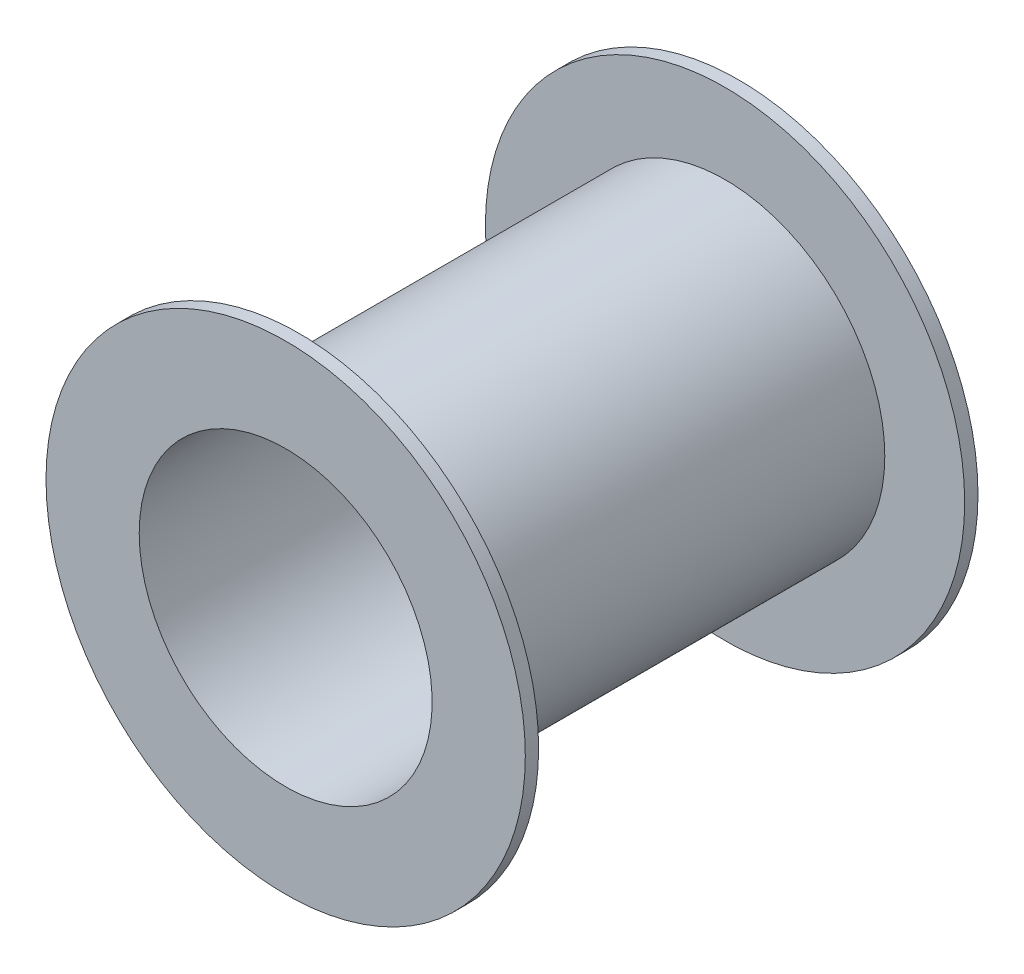
ISO-10303-21;
HEADER;
FILE_DESCRIPTION(('STEP AP214'),'2;1');
FILE_NAME('part.step','',(''),(''),'','','');
FILE_SCHEMA(('AUTOMOTIVE_DESIGN { 1 0 10303 214 1 1 1 1 }'));
ENDSEC;
DATA;
#1=APPLICATION_CONTEXT('core data for automotive mechanical design processes');
#2=APPLICATION_PROTOCOL_DEFINITION('international standard','automotive_design',2000,#1);
#3=PRODUCT_CONTEXT('',#1,'mechanical');
#4=PRODUCT('Part','Part','',(#3));
#5=PRODUCT_RELATED_PRODUCT_CATEGORY('part','',(#4));
#6=PRODUCT_DEFINITION_FORMATION('','',#4);
#7=PRODUCT_DEFINITION_CONTEXT('part definition',#1,'design');
#8=PRODUCT_DEFINITION('design','',#6,#7);
#9=PRODUCT_DEFINITION_SHAPE('','',#8);
#10=(LENGTH_UNIT() NAMED_UNIT(*) SI_UNIT(.MILLI.,.METRE.));
#11=(NAMED_UNIT(*) PLANE_ANGLE_UNIT() SI_UNIT($,.RADIAN.));
#12=(NAMED_UNIT(*) SI_UNIT($,.STERADIAN.) SOLID_ANGLE_UNIT());
#13=UNCERTAINTY_MEASURE_WITH_UNIT(LENGTH_MEASURE(1.E-05),#10,'distance_accuracy_value','');
#14=(GEOMETRIC_REPRESENTATION_CONTEXT(3) GLOBAL_UNCERTAINTY_ASSIGNED_CONTEXT((#13)) GLOBAL_UNIT_ASSIGNED_CONTEXT((#10,
#11,#12)) REPRESENTATION_CONTEXT('',''));
#15=CARTESIAN_POINT('',(0.,0.,0.));
#16=DIRECTION('',(0.,0.,1.));
#17=DIRECTION('',(1.,0.,0.));
#18=AXIS2_PLACEMENT_3D('',#15,#16,#17);
#19=CARTESIAN_POINT('',(0.,0.,0.));
#20=DIRECTION('',(0.,0.,-1.));
#21=DIRECTION('',(-1.,0.,0.));
#22=AXIS2_PLACEMENT_3D('',#19,#20,#21);
#23=CYLINDRICAL_SURFACE('',#22,0.55);
#24=CARTESIAN_POINT('',(0.,0.,-0.85));
#25=DIRECTION('',(0.,0.,-1.));
#26=DIRECTION('',(-1.,0.,0.));
#27=AXIS2_PLACEMENT_3D('',#24,#25,#26);
#28=CIRCLE('',#27,0.55);
#29=CARTESIAN_POINT('',(-0.55,0.,-0.85));
#30=VERTEX_POINT('',#29);
#31=EDGE_CURVE('E10',#30,#30,#28,.T.);
#32=ORIENTED_EDGE('',*,*,#31,.T.);
#33=EDGE_LOOP('',(#32));
#34=FACE_BOUND('',#33,.T.);
#35=CARTESIAN_POINT('',(0.,0.,0.85));
#36=DIRECTION('',(0.,0.,-1.));
#37=DIRECTION('',(-1.,0.,0.));
#38=AXIS2_PLACEMENT_3D('',#35,#36,#37);
#39=CIRCLE('',#38,0.55);
#40=CARTESIAN_POINT('',(-0.55,0.,0.85));
#41=VERTEX_POINT('',#40);
#42=EDGE_CURVE('E63',#41,#41,#39,.T.);
#43=ORIENTED_EDGE('',*,*,#42,.F.);
#44=EDGE_LOOP('',(#43));
#45=FACE_BOUND('',#44,.T.);
#46=ADVANCED_FACE('F35',(#34,#45),#23,.F.);
#47=CARTESIAN_POINT('',(-0.55,0.,-0.85));
#48=DIRECTION('',(0.,0.,-1.));
#49=DIRECTION('',(-1.,0.,0.));
#50=AXIS2_PLACEMENT_3D('',#47,#48,#49);
#51=PLANE('',#50);
#52=CARTESIAN_POINT('',(0.,0.,-0.85));
#53=DIRECTION('',(0.,0.,-1.));
#54=DIRECTION('',(-1.,0.,0.));
#55=AXIS2_PLACEMENT_3D('',#52,#53,#54);
#56=CIRCLE('',#55,0.9);
#57=CARTESIAN_POINT('',(-0.9,0.,-0.85));
#58=VERTEX_POINT('',#57);
#59=EDGE_CURVE('E41',#58,#58,#56,.T.);
#60=ORIENTED_EDGE('',*,*,#59,.T.);
#61=EDGE_LOOP('',(#60));
#62=FACE_BOUND('',#61,.T.);
#63=ORIENTED_EDGE('',*,*,#31,.F.);
#64=EDGE_LOOP('',(#63));
#65=FACE_BOUND('',#64,.T.);
#66=ADVANCED_FACE('F71',(#62,#65),#51,.T.);
#67=CARTESIAN_POINT('',(0.,0.,0.));
#68=DIRECTION('',(0.,0.,-1.));
#69=DIRECTION('',(-1.,0.,0.));
#70=AXIS2_PLACEMENT_3D('',#67,#68,#69);
#71=CYLINDRICAL_SURFACE('',#70,0.9);
#72=CARTESIAN_POINT('',(0.,0.,-0.8));
#73=DIRECTION('',(0.,0.,-1.));
#74=DIRECTION('',(-1.,0.,0.));
#75=AXIS2_PLACEMENT_3D('',#72,#73,#74);
#76=CIRCLE('',#75,0.9);
#77=CARTESIAN_POINT('',(-0.9,0.,-0.8));
#78=VERTEX_POINT('',#77);
#79=EDGE_CURVE('E45',#78,#78,#76,.T.);
#80=ORIENTED_EDGE('',*,*,#79,.T.);
#81=EDGE_LOOP('',(#80));
#82=FACE_BOUND('',#81,.T.);
#83=ORIENTED_EDGE('',*,*,#59,.F.);
#84=EDGE_LOOP('',(#83));
#85=FACE_BOUND('',#84,.T.);
#86=ADVANCED_FACE('F75',(#82,#85),#71,.T.);
#87=CARTESIAN_POINT('',(-0.9,0.,-0.8));
#88=DIRECTION('',(0.,0.,1.));
#89=DIRECTION('',(1.,0.,0.));
#90=AXIS2_PLACEMENT_3D('',#87,#88,#89);
#91=PLANE('',#90);
#92=CARTESIAN_POINT('',(0.,0.,-0.8));
#93=DIRECTION('',(0.,0.,-1.));
#94=DIRECTION('',(-1.,0.,0.));
#95=AXIS2_PLACEMENT_3D('',#92,#93,#94);
#96=CIRCLE('',#95,0.6);
#97=CARTESIAN_POINT('',(-0.6,0.,-0.8));
#98=VERTEX_POINT('',#97);
#99=EDGE_CURVE('E49',#98,#98,#96,.T.);
#100=ORIENTED_EDGE('',*,*,#99,.T.);
#101=EDGE_LOOP('',(#100));
#102=FACE_BOUND('',#101,.T.);
#103=ORIENTED_EDGE('',*,*,#79,.F.);
#104=EDGE_LOOP('',(#103));
#105=FACE_BOUND('',#104,.T.);
#106=ADVANCED_FACE('F79',(#102,#105),#91,.T.);
#107=CARTESIAN_POINT('',(0.,0.,0.));
#108=DIRECTION('',(0.,0.,-1.));
#109=DIRECTION('',(-1.,0.,0.));
#110=AXIS2_PLACEMENT_3D('',#107,#108,#109);
#111=CYLINDRICAL_SURFACE('',#110,0.6);
#112=CARTESIAN_POINT('',(0.,0.,0.8));
#113=DIRECTION('',(0.,0.,-1.));
#114=DIRECTION('',(-1.,0.,0.));
#115=AXIS2_PLACEMENT_3D('',#112,#113,#114);
#116=CIRCLE('',#115,0.6);
#117=CARTESIAN_POINT('',(-0.6,0.,0.8));
#118=VERTEX_POINT('',#117);
#119=EDGE_CURVE('E54',#118,#118,#116,.T.);
#120=ORIENTED_EDGE('',*,*,#119,.T.);
#121=EDGE_LOOP('',(#120));
#122=FACE_BOUND('',#121,.T.);
#123=ORIENTED_EDGE('',*,*,#99,.F.);
#124=EDGE_LOOP('',(#123));
#125=FACE_BOUND('',#124,.T.);
#126=ADVANCED_FACE('F86',(#122,#125),#111,.T.);
#127=CARTESIAN_POINT('',(-0.6,0.,0.8));
#128=DIRECTION('',(0.,0.,-1.));
#129=DIRECTION('',(-1.,0.,0.));
#130=AXIS2_PLACEMENT_3D('',#127,#128,#129);
#131=PLANE('',#130);
#132=CARTESIAN_POINT('',(0.,0.,0.8));
#133=DIRECTION('',(0.,0.,-1.));
#134=DIRECTION('',(-1.,0.,0.));
#135=AXIS2_PLACEMENT_3D('',#132,#133,#134);
#136=CIRCLE('',#135,0.9);
#137=CARTESIAN_POINT('',(-0.9,0.,0.8));
#138=VERTEX_POINT('',#137);
#139=EDGE_CURVE('E57',#138,#138,#136,.T.);
#140=ORIENTED_EDGE('',*,*,#139,.T.);
#141=EDGE_LOOP('',(#140));
#142=FACE_BOUND('',#141,.T.);
#143=ORIENTED_EDGE('',*,*,#119,.F.);
#144=EDGE_LOOP('',(#143));
#145=FACE_BOUND('',#144,.T.);
#146=ADVANCED_FACE('F90',(#142,#145),#131,.T.);
#147=CARTESIAN_POINT('',(0.,0.,0.));
#148=DIRECTION('',(0.,0.,-1.));
#149=DIRECTION('',(-1.,0.,0.));
#150=AXIS2_PLACEMENT_3D('',#147,#148,#149);
#151=CYLINDRICAL_SURFACE('',#150,0.9);
#152=CARTESIAN_POINT('',(0.,0.,0.85));
#153=DIRECTION('',(0.,0.,-1.));
#154=DIRECTION('',(-1.,0.,0.));
#155=AXIS2_PLACEMENT_3D('',#152,#153,#154);
#156=CIRCLE('',#155,0.9);
#157=CARTESIAN_POINT('',(-0.9,0.,0.85));
#158=VERTEX_POINT('',#157);
#159=EDGE_CURVE('E60',#158,#158,#156,.T.);
#160=ORIENTED_EDGE('',*,*,#159,.T.);
#161=EDGE_LOOP('',(#160));
#162=FACE_BOUND('',#161,.T.);
#163=ORIENTED_EDGE('',*,*,#139,.F.);
#164=EDGE_LOOP('',(#163));
#165=FACE_BOUND('',#164,.T.);
#166=ADVANCED_FACE('F94',(#162,#165),#151,.T.);
#167=CARTESIAN_POINT('',(-0.9,0.,0.85));
#168=DIRECTION('',(0.,0.,1.));
#169=DIRECTION('',(1.,0.,0.));
#170=AXIS2_PLACEMENT_3D('',#167,#168,#169);
#171=PLANE('',#170);
#172=ORIENTED_EDGE('',*,*,#42,.T.);
#173=EDGE_LOOP('',(#172));
#174=FACE_BOUND('',#173,.T.);
#175=ORIENTED_EDGE('',*,*,#159,.F.);
#176=EDGE_LOOP('',(#175));
#177=FACE_BOUND('',#176,.T.);
#178=ADVANCED_FACE('F67',(#174,#177),#171,.T.);
#179=CLOSED_SHELL('',(#46,#66,#86,#106,#126,#146,#166,#178));
#180=MANIFOLD_SOLID_BREP('B2',#179);
#181=ADVANCED_BREP_SHAPE_REPRESENTATION('',(#18,#180),#14);
#182=SHAPE_DEFINITION_REPRESENTATION(#9,#181);
ENDSEC;
END-ISO-10303-21;
